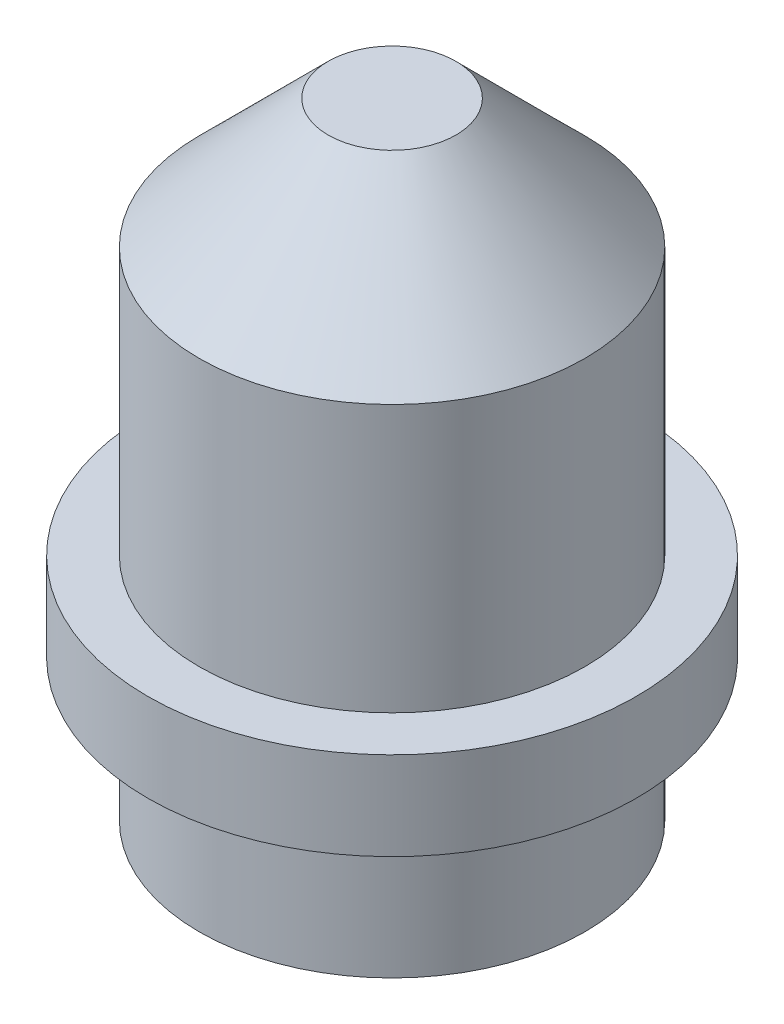
ISO-10303-21;
HEADER;
FILE_DESCRIPTION(('STEP AP214'),'2;1');
FILE_NAME('part.step','',(''),(''),'','','');
FILE_SCHEMA(('AUTOMOTIVE_DESIGN { 1 0 10303 214 1 1 1 1 }'));
ENDSEC;
DATA;
#1=APPLICATION_CONTEXT('core data for automotive mechanical design processes');
#2=APPLICATION_PROTOCOL_DEFINITION('international standard','automotive_design',2000,#1);
#3=PRODUCT_CONTEXT('',#1,'mechanical');
#4=PRODUCT('Part','Part','',(#3));
#5=PRODUCT_RELATED_PRODUCT_CATEGORY('part','',(#4));
#6=PRODUCT_DEFINITION_FORMATION('','',#4);
#7=PRODUCT_DEFINITION_CONTEXT('part definition',#1,'design');
#8=PRODUCT_DEFINITION('design','',#6,#7);
#9=PRODUCT_DEFINITION_SHAPE('','',#8);
#10=(LENGTH_UNIT() NAMED_UNIT(*) SI_UNIT(.MILLI.,.METRE.));
#11=(NAMED_UNIT(*) PLANE_ANGLE_UNIT() SI_UNIT($,.RADIAN.));
#12=(NAMED_UNIT(*) SI_UNIT($,.STERADIAN.) SOLID_ANGLE_UNIT());
#13=UNCERTAINTY_MEASURE_WITH_UNIT(LENGTH_MEASURE(1.E-05),#10,'distance_accuracy_value','');
#14=(GEOMETRIC_REPRESENTATION_CONTEXT(3) GLOBAL_UNCERTAINTY_ASSIGNED_CONTEXT((#13)) GLOBAL_UNIT_ASSIGNED_CONTEXT((#10,
#11,#12)) REPRESENTATION_CONTEXT('',''));
#15=CARTESIAN_POINT('',(0.,0.,0.));
#16=DIRECTION('',(0.,0.,1.));
#17=DIRECTION('',(1.,0.,0.));
#18=AXIS2_PLACEMENT_3D('',#15,#16,#17);
#19=CARTESIAN_POINT('',(-3.,3.57201372182184,0.));
#20=DIRECTION('',(0.,1.,0.));
#21=DIRECTION('',(0.,0.,1.));
#22=AXIS2_PLACEMENT_3D('',#19,#20,#21);
#23=PLANE('',#22);
#24=CARTESIAN_POINT('',(0.,3.57201372182184,0.));
#25=DIRECTION('',(0.,1.,0.));
#26=DIRECTION('',(0.,0.,1.));
#27=AXIS2_PLACEMENT_3D('',#24,#25,#26);
#28=CIRCLE('',#27,3.8);
#29=CARTESIAN_POINT('',(0.,3.57201372182184,3.8));
#30=VERTEX_POINT('',#29);
#31=EDGE_CURVE('E10',#30,#30,#28,.T.);
#32=ORIENTED_EDGE('',*,*,#31,.T.);
#33=EDGE_LOOP('',(#32));
#34=FACE_BOUND('',#33,.T.);
#35=CARTESIAN_POINT('',(0.,3.57201372182184,0.));
#36=DIRECTION('',(0.,1.,0.));
#37=DIRECTION('',(0.,0.,1.));
#38=AXIS2_PLACEMENT_3D('',#35,#36,#37);
#39=CIRCLE('',#38,3.);
#40=CARTESIAN_POINT('',(0.,3.57201372182184,3.));
#41=VERTEX_POINT('',#40);
#42=EDGE_CURVE('E56',#41,#41,#39,.T.);
#43=ORIENTED_EDGE('',*,*,#42,.F.);
#44=EDGE_LOOP('',(#43));
#45=FACE_BOUND('',#44,.T.);
#46=ADVANCED_FACE('F31',(#34,#45),#23,.T.);
#47=CARTESIAN_POINT('',(0.,14.5880413471286,0.));
#48=DIRECTION('',(0.,1.,0.));
#49=DIRECTION('',(0.,0.,1.));
#50=AXIS2_PLACEMENT_3D('',#47,#48,#49);
#51=CYLINDRICAL_SURFACE('',#50,3.8);
#52=CARTESIAN_POINT('',(0.,2.2,0.));
#53=DIRECTION('',(0.,1.,0.));
#54=DIRECTION('',(0.,0.,1.));
#55=AXIS2_PLACEMENT_3D('',#52,#53,#54);
#56=CIRCLE('',#55,3.8);
#57=CARTESIAN_POINT('',(0.,2.2,3.8));
#58=VERTEX_POINT('',#57);
#59=EDGE_CURVE('E37',#58,#58,#56,.T.);
#60=ORIENTED_EDGE('',*,*,#59,.T.);
#61=EDGE_LOOP('',(#60));
#62=FACE_BOUND('',#61,.T.);
#63=ORIENTED_EDGE('',*,*,#31,.F.);
#64=EDGE_LOOP('',(#63));
#65=FACE_BOUND('',#64,.T.);
#66=ADVANCED_FACE('F64',(#62,#65),#51,.T.);
#67=CARTESIAN_POINT('',(-3.8,2.2,0.));
#68=DIRECTION('',(0.,-1.,0.));
#69=DIRECTION('',(0.,0.,-1.));
#70=AXIS2_PLACEMENT_3D('',#67,#68,#69);
#71=PLANE('',#70);
#72=CARTESIAN_POINT('',(0.,2.2,0.));
#73=DIRECTION('',(0.,1.,0.));
#74=DIRECTION('',(0.,0.,1.));
#75=AXIS2_PLACEMENT_3D('',#72,#73,#74);
#76=CIRCLE('',#75,3.);
#77=CARTESIAN_POINT('',(0.,2.2,3.));
#78=VERTEX_POINT('',#77);
#79=EDGE_CURVE('E41',#78,#78,#76,.T.);
#80=ORIENTED_EDGE('',*,*,#79,.T.);
#81=EDGE_LOOP('',(#80));
#82=FACE_BOUND('',#81,.T.);
#83=ORIENTED_EDGE('',*,*,#59,.F.);
#84=EDGE_LOOP('',(#83));
#85=FACE_BOUND('',#84,.T.);
#86=ADVANCED_FACE('F68',(#82,#85),#71,.T.);
#87=CARTESIAN_POINT('',(0.,14.5880413471286,0.));
#88=DIRECTION('',(0.,1.,0.));
#89=DIRECTION('',(0.,0.,1.));
#90=AXIS2_PLACEMENT_3D('',#87,#88,#89);
#91=CYLINDRICAL_SURFACE('',#90,3.);
#92=CARTESIAN_POINT('',(0.,0.,0.));
#93=DIRECTION('',(0.,1.,0.));
#94=DIRECTION('',(0.,0.,1.));
#95=AXIS2_PLACEMENT_3D('',#92,#93,#94);
#96=CIRCLE('',#95,3.);
#97=CARTESIAN_POINT('',(0.,0.,3.));
#98=VERTEX_POINT('',#97);
#99=EDGE_CURVE('E45',#98,#98,#96,.T.);
#100=ORIENTED_EDGE('',*,*,#99,.T.);
#101=EDGE_LOOP('',(#100));
#102=FACE_BOUND('',#101,.T.);
#103=ORIENTED_EDGE('',*,*,#79,.F.);
#104=EDGE_LOOP('',(#103));
#105=FACE_BOUND('',#104,.T.);
#106=ADVANCED_FACE('F72',(#102,#105),#91,.T.);
#107=CARTESIAN_POINT('',(-3.,0.,0.));
#108=DIRECTION('',(0.,-1.,0.));
#109=DIRECTION('',(0.,0.,-1.));
#110=AXIS2_PLACEMENT_3D('',#107,#108,#109);
#111=PLANE('',#110);
#112=ORIENTED_EDGE('',*,*,#99,.F.);
#113=EDGE_LOOP('',(#112));
#114=FACE_BOUND('',#113,.T.);
#115=ADVANCED_FACE('F79',(#114),#111,.T.);
#116=CARTESIAN_POINT('',(0.,9.73129777977844,0.));
#117=DIRECTION('',(0.,1.,0.));
#118=DIRECTION('',(0.,0.,1.));
#119=AXIS2_PLACEMENT_3D('',#116,#117,#118);
#120=PLANE('',#119);
#121=CARTESIAN_POINT('',(0.,9.73129777977844,0.));
#122=DIRECTION('',(0.,1.,0.));
#123=DIRECTION('',(0.,0.,1.));
#124=AXIS2_PLACEMENT_3D('',#121,#122,#123);
#125=CIRCLE('',#124,0.99394651027998);
#126=CARTESIAN_POINT('',(0.,9.73129777977844,0.99394651027998));
#127=VERTEX_POINT('',#126);
#128=EDGE_CURVE('E50',#127,#127,#125,.T.);
#129=ORIENTED_EDGE('',*,*,#128,.T.);
#130=EDGE_LOOP('',(#129));
#131=FACE_BOUND('',#130,.T.);
#132=ADVANCED_FACE('F83',(#131),#120,.T.);
#133=CARTESIAN_POINT('',(0.,9.73129777977844,0.));
#134=DIRECTION('',(0.,-1.,0.));
#135=DIRECTION('',(0.,0.,-1.));
#136=AXIS2_PLACEMENT_3D('',#133,#134,#135);
#137=CONICAL_SURFACE('',#136,0.99394651027998,0.785398163397448);
#138=CARTESIAN_POINT('',(0.,7.72524429005842,0.));
#139=DIRECTION('',(0.,1.,0.));
#140=DIRECTION('',(0.,0.,1.));
#141=AXIS2_PLACEMENT_3D('',#138,#139,#140);
#142=CIRCLE('',#141,3.);
#143=CARTESIAN_POINT('',(0.,7.72524429005842,3.));
#144=VERTEX_POINT('',#143);
#145=EDGE_CURVE('E53',#144,#144,#142,.T.);
#146=ORIENTED_EDGE('',*,*,#145,.T.);
#147=EDGE_LOOP('',(#146));
#148=FACE_BOUND('',#147,.T.);
#149=ORIENTED_EDGE('',*,*,#128,.F.);
#150=EDGE_LOOP('',(#149));
#151=FACE_BOUND('',#150,.T.);
#152=ADVANCED_FACE('F87',(#148,#151),#137,.T.);
#153=CARTESIAN_POINT('',(0.,14.5880413471286,0.));
#154=DIRECTION('',(0.,1.,0.));
#155=DIRECTION('',(0.,0.,1.));
#156=AXIS2_PLACEMENT_3D('',#153,#154,#155);
#157=CYLINDRICAL_SURFACE('',#156,3.);
#158=ORIENTED_EDGE('',*,*,#42,.T.);
#159=EDGE_LOOP('',(#158));
#160=FACE_BOUND('',#159,.T.);
#161=ORIENTED_EDGE('',*,*,#145,.F.);
#162=EDGE_LOOP('',(#161));
#163=FACE_BOUND('',#162,.T.);
#164=ADVANCED_FACE('F60',(#160,#163),#157,.T.);
#165=CLOSED_SHELL('',(#46,#66,#86,#106,#115,#132,#152,#164));
#166=MANIFOLD_SOLID_BREP('B2',#165);
#167=ADVANCED_BREP_SHAPE_REPRESENTATION('',(#18,#166),#14);
#168=SHAPE_DEFINITION_REPRESENTATION(#9,#167);
ENDSEC;
END-ISO-10303-21;
